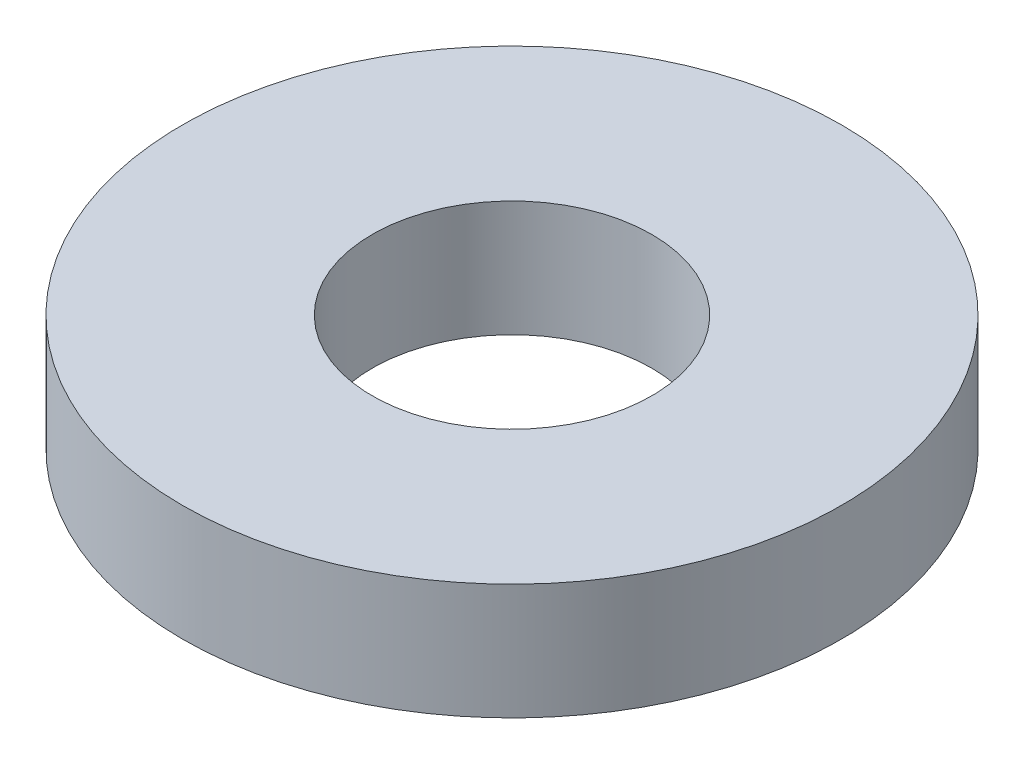
ISO-10303-21;
HEADER;
FILE_DESCRIPTION(('STEP AP214'),'2;1');
FILE_NAME('part.step','',(''),(''),'','','');
FILE_SCHEMA(('AUTOMOTIVE_DESIGN { 1 0 10303 214 1 1 1 1 }'));
ENDSEC;
DATA;
#1=APPLICATION_CONTEXT('core data for automotive mechanical design processes');
#2=APPLICATION_PROTOCOL_DEFINITION('international standard','automotive_design',2000,#1);
#3=PRODUCT_CONTEXT('',#1,'mechanical');
#4=PRODUCT('Part','Part','',(#3));
#5=PRODUCT_RELATED_PRODUCT_CATEGORY('part','',(#4));
#6=PRODUCT_DEFINITION_FORMATION('','',#4);
#7=PRODUCT_DEFINITION_CONTEXT('part definition',#1,'design');
#8=PRODUCT_DEFINITION('design','',#6,#7);
#9=PRODUCT_DEFINITION_SHAPE('','',#8);
#10=(LENGTH_UNIT() NAMED_UNIT(*) SI_UNIT(.MILLI.,.METRE.));
#11=(NAMED_UNIT(*) PLANE_ANGLE_UNIT() SI_UNIT($,.RADIAN.));
#12=(NAMED_UNIT(*) SI_UNIT($,.STERADIAN.) SOLID_ANGLE_UNIT());
#13=UNCERTAINTY_MEASURE_WITH_UNIT(LENGTH_MEASURE(1.E-05),#10,'distance_accuracy_value','');
#14=(GEOMETRIC_REPRESENTATION_CONTEXT(3) GLOBAL_UNCERTAINTY_ASSIGNED_CONTEXT((#13)) GLOBAL_UNIT_ASSIGNED_CONTEXT((#10,
#11,#12)) REPRESENTATION_CONTEXT('',''));
#15=CARTESIAN_POINT('',(0.,0.,0.));
#16=DIRECTION('',(0.,0.,1.));
#17=DIRECTION('',(1.,0.,0.));
#18=AXIS2_PLACEMENT_3D('',#15,#16,#17);
#19=CARTESIAN_POINT('',(0.,29.,0.));
#20=DIRECTION('',(0.,-1.,0.));
#21=DIRECTION('',(0.,0.,-1.));
#22=AXIS2_PLACEMENT_3D('',#19,#20,#21);
#23=CYLINDRICAL_SURFACE('',#22,82.5);
#24=CARTESIAN_POINT('',(0.,29.,0.));
#25=DIRECTION('',(0.,1.,0.));
#26=DIRECTION('',(0.,0.,1.));
#27=AXIS2_PLACEMENT_3D('',#24,#25,#26);
#28=CIRCLE('',#27,82.5);
#29=CARTESIAN_POINT('',(0.,29.,-82.5));
#30=VERTEX_POINT('',#29);
#31=EDGE_CURVE('E10',#30,#30,#28,.T.);
#32=CARTESIAN_POINT('',(0.,0.,0.));
#33=DIRECTION('',(0.,1.,0.));
#34=DIRECTION('',(0.,0.,1.));
#35=AXIS2_PLACEMENT_3D('',#32,#33,#34);
#36=CIRCLE('',#35,82.5);
#37=CARTESIAN_POINT('',(0.,0.,-82.5));
#38=VERTEX_POINT('',#37);
#39=EDGE_CURVE('E37',#38,#38,#36,.T.);
#40=CARTESIAN_POINT('',(0.,29.,-82.5));
#41=CARTESIAN_POINT('',(0.,28.6979166666667,-82.5));
#42=CARTESIAN_POINT('',(0.,28.3958333333333,-82.5));
#43=CARTESIAN_POINT('',(0.,27.7916666666667,-82.5));
#44=CARTESIAN_POINT('',(0.,27.4895833333333,-82.5));
#45=CARTESIAN_POINT('',(0.,26.8854166666667,-82.5));
#46=CARTESIAN_POINT('',(0.,26.5833333333333,-82.5));
#47=CARTESIAN_POINT('',(0.,25.9791666666667,-82.5));
#48=CARTESIAN_POINT('',(0.,25.6770833333333,-82.5));
#49=CARTESIAN_POINT('',(0.,25.0729166666667,-82.5));
#50=CARTESIAN_POINT('',(0.,24.7708333333333,-82.5));
#51=CARTESIAN_POINT('',(0.,24.1666666666667,-82.5));
#52=CARTESIAN_POINT('',(0.,23.8645833333333,-82.5));
#53=CARTESIAN_POINT('',(0.,23.2604166666667,-82.5));
#54=CARTESIAN_POINT('',(0.,22.9583333333333,-82.5));
#55=CARTESIAN_POINT('',(0.,22.3541666666667,-82.5));
#56=CARTESIAN_POINT('',(0.,22.0520833333333,-82.5));
#57=CARTESIAN_POINT('',(0.,21.4479166666667,-82.5));
#58=CARTESIAN_POINT('',(0.,21.1458333333333,-82.5));
#59=CARTESIAN_POINT('',(0.,20.5416666666667,-82.5));
#60=CARTESIAN_POINT('',(0.,20.2395833333333,-82.5));
#61=CARTESIAN_POINT('',(0.,19.6354166666667,-82.5));
#62=CARTESIAN_POINT('',(0.,19.3333333333333,-82.5));
#63=CARTESIAN_POINT('',(0.,18.7291666666667,-82.5));
#64=CARTESIAN_POINT('',(0.,18.4270833333333,-82.5));
#65=CARTESIAN_POINT('',(0.,17.8229166666667,-82.5));
#66=CARTESIAN_POINT('',(0.,17.5208333333333,-82.5));
#67=CARTESIAN_POINT('',(0.,16.9166666666667,-82.5));
#68=CARTESIAN_POINT('',(0.,16.6145833333333,-82.5));
#69=CARTESIAN_POINT('',(0.,16.0104166666667,-82.5));
#70=CARTESIAN_POINT('',(0.,15.7083333333333,-82.5));
#71=CARTESIAN_POINT('',(0.,15.1041666666667,-82.5));
#72=CARTESIAN_POINT('',(0.,14.8020833333333,-82.5));
#73=CARTESIAN_POINT('',(0.,14.1979166666667,-82.5));
#74=CARTESIAN_POINT('',(0.,13.8958333333333,-82.5));
#75=CARTESIAN_POINT('',(0.,13.2916666666667,-82.5));
#76=CARTESIAN_POINT('',(0.,12.9895833333333,-82.5));
#77=CARTESIAN_POINT('',(0.,12.3854166666667,-82.5));
#78=CARTESIAN_POINT('',(0.,12.0833333333333,-82.5));
#79=CARTESIAN_POINT('',(0.,11.4791666666667,-82.5));
#80=CARTESIAN_POINT('',(0.,11.1770833333333,-82.5));
#81=CARTESIAN_POINT('',(0.,10.5729166666667,-82.5));
#82=CARTESIAN_POINT('',(0.,10.2708333333333,-82.5));
#83=CARTESIAN_POINT('',(0.,9.66666666666667,-82.5));
#84=CARTESIAN_POINT('',(0.,9.36458333333333,-82.5));
#85=CARTESIAN_POINT('',(0.,8.76041666666667,-82.5));
#86=CARTESIAN_POINT('',(0.,8.45833333333333,-82.5));
#87=CARTESIAN_POINT('',(0.,7.85416666666667,-82.5));
#88=CARTESIAN_POINT('',(0.,7.55208333333333,-82.5));
#89=CARTESIAN_POINT('',(0.,6.94791666666667,-82.5));
#90=CARTESIAN_POINT('',(0.,6.64583333333333,-82.5));
#91=CARTESIAN_POINT('',(0.,6.04166666666667,-82.5));
#92=CARTESIAN_POINT('',(0.,5.73958333333333,-82.5));
#93=CARTESIAN_POINT('',(0.,5.13541666666667,-82.5));
#94=CARTESIAN_POINT('',(0.,4.83333333333333,-82.5));
#95=CARTESIAN_POINT('',(0.,4.22916666666667,-82.5));
#96=CARTESIAN_POINT('',(0.,3.92708333333333,-82.5));
#97=CARTESIAN_POINT('',(0.,3.32291666666667,-82.5));
#98=CARTESIAN_POINT('',(0.,3.02083333333333,-82.5));
#99=CARTESIAN_POINT('',(0.,2.41666666666667,-82.5));
#100=CARTESIAN_POINT('',(0.,2.11458333333333,-82.5));
#101=CARTESIAN_POINT('',(0.,1.51041666666667,-82.5));
#102=CARTESIAN_POINT('',(0.,1.20833333333333,-82.5));
#103=CARTESIAN_POINT('',(0.,0.604166666666667,-82.5));
#104=CARTESIAN_POINT('',(0.,0.302083333333333,-82.5));
#105=CARTESIAN_POINT('',(0.,0.,-82.5));
#106=B_SPLINE_CURVE_WITH_KNOTS('',3,(#40,#41,#42,#43,#44,#45,#46,#47,#48,#49,#50,#51,#52,#53,
#54,#55,#56,#57,#58,#59,#60,#61,#62,#63,#64,#65,#66,#67,#68,#69,#70,#71,#72,#73,#74,#75,#76,#77,
#78,#79,#80,#81,#82,#83,#84,#85,#86,#87,#88,#89,#90,#91,#92,#93,#94,#95,#96,#97,#98,#99,#100,
#101,#102,#103,#104,#105),.UNSPECIFIED.,.F.,.F.,(4,2,2,2,2,2,2,2,2,2,2,2,2,2,2,2,2,2,2,2,2,2,2,
2,2,2,2,2,2,2,2,2,4),(0.,0.906249999999997,1.8125,2.71875,3.625,4.53125,5.4375,6.34375,7.25,
8.15625,9.0625,9.96875,10.875,11.78125,12.6875,13.59375,14.5,15.40625,16.3125,17.21875,18.125,
19.03125,19.9375,20.84375,21.75,22.65625,23.5625,24.46875,25.375,26.28125,27.1875,28.09375,29.),.UNSPECIFIED.);
#107=EDGE_CURVE('BSEAM40',#30,#38,#106,.T.);
#108=ORIENTED_EDGE('',*,*,#31,.F.);
#109=ORIENTED_EDGE('',*,*,#39,.T.);
#110=ORIENTED_EDGE('',*,*,#107,.T.);
#111=ORIENTED_EDGE('',*,*,#107,.F.);
#112=EDGE_LOOP('',(#108,#110,#109,#111));
#113=FACE_BOUND('',#112,.T.);
#114=ADVANCED_FACE('F40',(#113),#23,.T.);
#115=CARTESIAN_POINT('',(0.,29.,0.));
#116=DIRECTION('',(0.,1.,0.));
#117=DIRECTION('',(0.,0.,1.));
#118=AXIS2_PLACEMENT_3D('',#115,#116,#117);
#119=PLANE('',#118);
#120=CARTESIAN_POINT('',(0.,29.,0.));
#121=DIRECTION('',(0.,1.,0.));
#122=DIRECTION('',(0.,0.,1.));
#123=AXIS2_PLACEMENT_3D('',#120,#121,#122);
#124=CIRCLE('',#123,35.);
#125=CARTESIAN_POINT('',(0.,29.,-35.));
#126=VERTEX_POINT('',#125);
#127=EDGE_CURVE('E50',#126,#126,#124,.T.);
#128=ORIENTED_EDGE('',*,*,#127,.F.);
#129=EDGE_LOOP('',(#128));
#130=FACE_BOUND('',#129,.T.);
#131=ORIENTED_EDGE('',*,*,#31,.T.);
#132=EDGE_LOOP('',(#131));
#133=FACE_BOUND('',#132,.T.);
#134=ADVANCED_FACE('F59',(#130,#133),#119,.T.);
#135=CARTESIAN_POINT('',(0.,0.,0.));
#136=DIRECTION('',(0.,1.,0.));
#137=DIRECTION('',(0.,0.,1.));
#138=AXIS2_PLACEMENT_3D('',#135,#136,#137);
#139=PLANE('',#138);
#140=CARTESIAN_POINT('',(0.,0.,0.));
#141=DIRECTION('',(0.,1.,0.));
#142=DIRECTION('',(0.,0.,1.));
#143=AXIS2_PLACEMENT_3D('',#140,#141,#142);
#144=CIRCLE('',#143,35.);
#145=CARTESIAN_POINT('',(0.,0.,-35.));
#146=VERTEX_POINT('',#145);
#147=EDGE_CURVE('E47',#146,#146,#144,.T.);
#148=ORIENTED_EDGE('',*,*,#147,.T.);
#149=EDGE_LOOP('',(#148));
#150=FACE_BOUND('',#149,.T.);
#151=ORIENTED_EDGE('',*,*,#39,.F.);
#152=EDGE_LOOP('',(#151));
#153=FACE_BOUND('',#152,.T.);
#154=ADVANCED_FACE('F58',(#150,#153),#139,.F.);
#155=CARTESIAN_POINT('',(0.,29.,0.));
#156=DIRECTION('',(0.,-1.,0.));
#157=DIRECTION('',(0.,0.,-1.));
#158=AXIS2_PLACEMENT_3D('',#155,#156,#157);
#159=CYLINDRICAL_SURFACE('',#158,35.);
#160=CARTESIAN_POINT('',(0.,29.,-35.));
#161=CARTESIAN_POINT('',(0.,28.6979166666667,-35.));
#162=CARTESIAN_POINT('',(0.,28.3958333333333,-35.));
#163=CARTESIAN_POINT('',(0.,27.7916666666667,-35.));
#164=CARTESIAN_POINT('',(0.,27.4895833333333,-35.));
#165=CARTESIAN_POINT('',(0.,26.8854166666667,-35.));
#166=CARTESIAN_POINT('',(0.,26.5833333333333,-35.));
#167=CARTESIAN_POINT('',(0.,25.9791666666667,-35.));
#168=CARTESIAN_POINT('',(0.,25.6770833333333,-35.));
#169=CARTESIAN_POINT('',(0.,25.0729166666667,-35.));
#170=CARTESIAN_POINT('',(0.,24.7708333333333,-35.));
#171=CARTESIAN_POINT('',(0.,24.1666666666667,-35.));
#172=CARTESIAN_POINT('',(0.,23.8645833333333,-35.));
#173=CARTESIAN_POINT('',(0.,23.2604166666667,-35.));
#174=CARTESIAN_POINT('',(0.,22.9583333333333,-35.));
#175=CARTESIAN_POINT('',(0.,22.3541666666667,-35.));
#176=CARTESIAN_POINT('',(0.,22.0520833333333,-35.));
#177=CARTESIAN_POINT('',(0.,21.4479166666667,-35.));
#178=CARTESIAN_POINT('',(0.,21.1458333333333,-35.));
#179=CARTESIAN_POINT('',(0.,20.5416666666667,-35.));
#180=CARTESIAN_POINT('',(0.,20.2395833333333,-35.));
#181=CARTESIAN_POINT('',(0.,19.6354166666667,-35.));
#182=CARTESIAN_POINT('',(0.,19.3333333333333,-35.));
#183=CARTESIAN_POINT('',(0.,18.7291666666667,-35.));
#184=CARTESIAN_POINT('',(0.,18.4270833333333,-35.));
#185=CARTESIAN_POINT('',(0.,17.8229166666667,-35.));
#186=CARTESIAN_POINT('',(0.,17.5208333333333,-35.));
#187=CARTESIAN_POINT('',(0.,16.9166666666667,-35.));
#188=CARTESIAN_POINT('',(0.,16.6145833333333,-35.));
#189=CARTESIAN_POINT('',(0.,16.0104166666667,-35.));
#190=CARTESIAN_POINT('',(0.,15.7083333333333,-35.));
#191=CARTESIAN_POINT('',(0.,15.1041666666667,-35.));
#192=CARTESIAN_POINT('',(0.,14.8020833333333,-35.));
#193=CARTESIAN_POINT('',(0.,14.1979166666667,-35.));
#194=CARTESIAN_POINT('',(0.,13.8958333333333,-35.));
#195=CARTESIAN_POINT('',(0.,13.2916666666667,-35.));
#196=CARTESIAN_POINT('',(0.,12.9895833333333,-35.));
#197=CARTESIAN_POINT('',(0.,12.3854166666667,-35.));
#198=CARTESIAN_POINT('',(0.,12.0833333333333,-35.));
#199=CARTESIAN_POINT('',(0.,11.4791666666667,-35.));
#200=CARTESIAN_POINT('',(0.,11.1770833333333,-35.));
#201=CARTESIAN_POINT('',(0.,10.5729166666667,-35.));
#202=CARTESIAN_POINT('',(0.,10.2708333333333,-35.));
#203=CARTESIAN_POINT('',(0.,9.66666666666667,-35.));
#204=CARTESIAN_POINT('',(0.,9.36458333333333,-35.));
#205=CARTESIAN_POINT('',(0.,8.76041666666667,-35.));
#206=CARTESIAN_POINT('',(0.,8.45833333333333,-35.));
#207=CARTESIAN_POINT('',(0.,7.85416666666667,-35.));
#208=CARTESIAN_POINT('',(0.,7.55208333333333,-35.));
#209=CARTESIAN_POINT('',(0.,6.94791666666667,-35.));
#210=CARTESIAN_POINT('',(0.,6.64583333333333,-35.));
#211=CARTESIAN_POINT('',(0.,6.04166666666667,-35.));
#212=CARTESIAN_POINT('',(0.,5.73958333333333,-35.));
#213=CARTESIAN_POINT('',(0.,5.13541666666667,-35.));
#214=CARTESIAN_POINT('',(0.,4.83333333333333,-35.));
#215=CARTESIAN_POINT('',(0.,4.22916666666667,-35.));
#216=CARTESIAN_POINT('',(0.,3.92708333333333,-35.));
#217=CARTESIAN_POINT('',(0.,3.32291666666667,-35.));
#218=CARTESIAN_POINT('',(0.,3.02083333333333,-35.));
#219=CARTESIAN_POINT('',(0.,2.41666666666667,-35.));
#220=CARTESIAN_POINT('',(0.,2.11458333333333,-35.));
#221=CARTESIAN_POINT('',(0.,1.51041666666667,-35.));
#222=CARTESIAN_POINT('',(0.,1.20833333333333,-35.));
#223=CARTESIAN_POINT('',(0.,0.604166666666667,-35.));
#224=CARTESIAN_POINT('',(0.,0.302083333333333,-35.));
#225=CARTESIAN_POINT('',(0.,0.,-35.));
#226=B_SPLINE_CURVE_WITH_KNOTS('',3,(#160,#161,#162,#163,#164,#165,#166,#167,#168,#169,#170,
#171,#172,#173,#174,#175,#176,#177,#178,#179,#180,#181,#182,#183,#184,#185,#186,#187,#188,#189,
#190,#191,#192,#193,#194,#195,#196,#197,#198,#199,#200,#201,#202,#203,#204,#205,#206,#207,#208,
#209,#210,#211,#212,#213,#214,#215,#216,#217,#218,#219,#220,#221,#222,#223,#224,#225),
.UNSPECIFIED.,.F.,.F.,(4,2,2,2,2,2,2,2,2,2,2,2,2,2,2,2,2,2,2,2,2,2,2,2,2,2,2,2,2,2,2,2,4),(0.,
0.906250000000001,1.8125,2.71875,3.625,4.53125,5.4375,6.34375,7.25,8.15625,9.0625,9.96875,
10.875,11.78125,12.6875,13.59375,14.5,15.40625,16.3125,17.21875,18.125,19.03125,19.9375,
20.84375,21.75,22.65625,23.5625,24.46875,25.375,26.28125,27.1875,28.09375,29.),.UNSPECIFIED.);
#227=EDGE_CURVE('BSEAM54',#126,#146,#226,.T.);
#228=ORIENTED_EDGE('',*,*,#127,.T.);
#229=ORIENTED_EDGE('',*,*,#147,.F.);
#230=ORIENTED_EDGE('',*,*,#227,.T.);
#231=ORIENTED_EDGE('',*,*,#227,.F.);
#232=EDGE_LOOP('',(#228,#230,#229,#231));
#233=FACE_BOUND('',#232,.T.);
#234=ADVANCED_FACE('F54',(#233),#159,.F.);
#235=CLOSED_SHELL('',(#114,#134,#154,#234));
#236=MANIFOLD_SOLID_BREP('B2',#235);
#237=ADVANCED_BREP_SHAPE_REPRESENTATION('',(#18,#236),#14);
#238=SHAPE_DEFINITION_REPRESENTATION(#9,#237);
ENDSEC;
END-ISO-10303-21;
